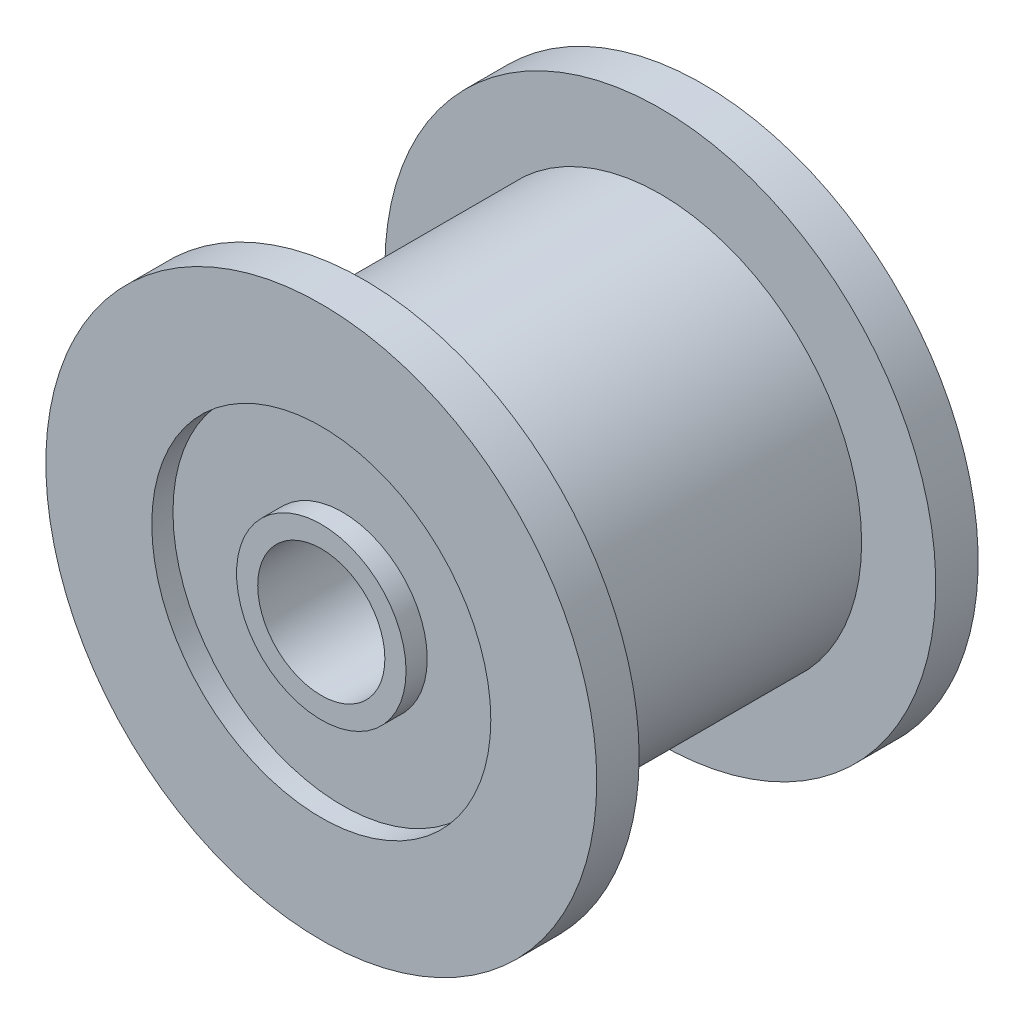
ISO-10303-21;
HEADER;
FILE_DESCRIPTION(('STEP AP214'),'2;1');
FILE_NAME('part.step','',(''),(''),'','','');
FILE_SCHEMA(('AUTOMOTIVE_DESIGN { 1 0 10303 214 1 1 1 1 }'));
ENDSEC;
DATA;
#1=APPLICATION_CONTEXT('core data for automotive mechanical design processes');
#2=APPLICATION_PROTOCOL_DEFINITION('international standard','automotive_design',2000,#1);
#3=PRODUCT_CONTEXT('',#1,'mechanical');
#4=PRODUCT('Part','Part','',(#3));
#5=PRODUCT_RELATED_PRODUCT_CATEGORY('part','',(#4));
#6=PRODUCT_DEFINITION_FORMATION('','',#4);
#7=PRODUCT_DEFINITION_CONTEXT('part definition',#1,'design');
#8=PRODUCT_DEFINITION('design','',#6,#7);
#9=PRODUCT_DEFINITION_SHAPE('','',#8);
#10=(LENGTH_UNIT() NAMED_UNIT(*) SI_UNIT(.MILLI.,.METRE.));
#11=(NAMED_UNIT(*) PLANE_ANGLE_UNIT() SI_UNIT($,.RADIAN.));
#12=(NAMED_UNIT(*) SI_UNIT($,.STERADIAN.) SOLID_ANGLE_UNIT());
#13=UNCERTAINTY_MEASURE_WITH_UNIT(LENGTH_MEASURE(1.E-05),#10,'distance_accuracy_value','');
#14=(GEOMETRIC_REPRESENTATION_CONTEXT(3) GLOBAL_UNCERTAINTY_ASSIGNED_CONTEXT((#13)) GLOBAL_UNIT_ASSIGNED_CONTEXT((#10,
#11,#12)) REPRESENTATION_CONTEXT('',''));
#15=CARTESIAN_POINT('',(0.,0.,0.));
#16=DIRECTION('',(0.,0.,1.));
#17=DIRECTION('',(1.,0.,0.));
#18=AXIS2_PLACEMENT_3D('',#15,#16,#17);
#19=CARTESIAN_POINT('',(0.,0.,8.));
#20=DIRECTION('',(0.,0.,1.));
#21=DIRECTION('',(1.,0.,0.));
#22=AXIS2_PLACEMENT_3D('',#19,#20,#21);
#23=PLANE('',#22);
#24=CARTESIAN_POINT('',(0.,0.,8.));
#25=DIRECTION('',(0.,0.,1.));
#26=DIRECTION('',(1.,0.,0.));
#27=AXIS2_PLACEMENT_3D('',#24,#25,#26);
#28=CIRCLE('',#27,1.5);
#29=CARTESIAN_POINT('',(1.5,0.,8.));
#30=VERTEX_POINT('',#29);
#31=EDGE_CURVE('E58',#30,#30,#28,.T.);
#32=ORIENTED_EDGE('',*,*,#31,.F.);
#33=EDGE_LOOP('',(#32));
#34=FACE_BOUND('',#33,.T.);
#35=CARTESIAN_POINT('',(0.,0.,8.));
#36=DIRECTION('',(0.,0.,1.));
#37=DIRECTION('',(1.,0.,0.));
#38=AXIS2_PLACEMENT_3D('',#35,#36,#37);
#39=CIRCLE('',#38,2.);
#40=CARTESIAN_POINT('',(2.,0.,8.));
#41=VERTEX_POINT('',#40);
#42=EDGE_CURVE('E85',#41,#41,#39,.T.);
#43=ORIENTED_EDGE('',*,*,#42,.T.);
#44=EDGE_LOOP('',(#43));
#45=FACE_BOUND('',#44,.T.);
#46=ADVANCED_FACE('F34',(#34,#45),#23,.T.);
#47=CARTESIAN_POINT('',(0.,0.,-1.));
#48=DIRECTION('',(0.,0.,-1.));
#49=DIRECTION('',(-1.,0.,0.));
#50=AXIS2_PLACEMENT_3D('',#47,#48,#49);
#51=PLANE('',#50);
#52=CARTESIAN_POINT('',(0.,0.,-1.));
#53=DIRECTION('',(0.,0.,-1.));
#54=DIRECTION('',(-1.,0.,0.));
#55=AXIS2_PLACEMENT_3D('',#52,#53,#54);
#56=CIRCLE('',#55,1.5);
#57=CARTESIAN_POINT('',(-1.5,0.,-1.));
#58=VERTEX_POINT('',#57);
#59=EDGE_CURVE('E63',#58,#58,#56,.T.);
#60=ORIENTED_EDGE('',*,*,#59,.F.);
#61=EDGE_LOOP('',(#60));
#62=FACE_BOUND('',#61,.T.);
#63=CARTESIAN_POINT('',(0.,0.,-1.));
#64=DIRECTION('',(0.,0.,-1.));
#65=DIRECTION('',(-1.,0.,0.));
#66=AXIS2_PLACEMENT_3D('',#63,#64,#65);
#67=CIRCLE('',#66,2.);
#68=CARTESIAN_POINT('',(-2.,0.,-1.));
#69=VERTEX_POINT('',#68);
#70=EDGE_CURVE('E73',#69,#69,#67,.T.);
#71=ORIENTED_EDGE('',*,*,#70,.T.);
#72=EDGE_LOOP('',(#71));
#73=FACE_BOUND('',#72,.T.);
#74=ADVANCED_FACE('F124',(#62,#73),#51,.T.);
#75=CARTESIAN_POINT('',(0.,0.,7.));
#76=DIRECTION('',(0.,0.,-1.));
#77=DIRECTION('',(-1.,0.,0.));
#78=AXIS2_PLACEMENT_3D('',#75,#76,#77);
#79=CYLINDRICAL_SURFACE('',#78,4.75);
#80=CARTESIAN_POINT('',(0.,0.,7.));
#81=DIRECTION('',(0.,0.,1.));
#82=DIRECTION('',(1.,0.,0.));
#83=AXIS2_PLACEMENT_3D('',#80,#81,#82);
#84=CIRCLE('',#83,4.75);
#85=CARTESIAN_POINT('',(4.75,0.,7.));
#86=VERTEX_POINT('',#85);
#87=EDGE_CURVE('E10',#86,#86,#84,.T.);
#88=ORIENTED_EDGE('',*,*,#87,.F.);
#89=EDGE_LOOP('',(#88));
#90=FACE_BOUND('',#89,.T.);
#91=CARTESIAN_POINT('',(0.,0.,0.));
#92=DIRECTION('',(0.,0.,-1.));
#93=DIRECTION('',(-1.,0.,0.));
#94=AXIS2_PLACEMENT_3D('',#91,#92,#93);
#95=CIRCLE('',#94,4.75);
#96=CARTESIAN_POINT('',(-4.75,0.,0.));
#97=VERTEX_POINT('',#96);
#98=EDGE_CURVE('E50',#97,#97,#95,.T.);
#99=ORIENTED_EDGE('',*,*,#98,.F.);
#100=EDGE_LOOP('',(#99));
#101=FACE_BOUND('',#100,.T.);
#102=ADVANCED_FACE('F36',(#90,#101),#79,.T.);
#103=CARTESIAN_POINT('',(0.,0.,7.));
#104=DIRECTION('',(0.,0.,1.));
#105=DIRECTION('',(1.,0.,0.));
#106=AXIS2_PLACEMENT_3D('',#103,#104,#105);
#107=PLANE('',#106);
#108=CARTESIAN_POINT('',(0.,0.,7.));
#109=DIRECTION('',(0.,0.,1.));
#110=DIRECTION('',(1.,0.,0.));
#111=AXIS2_PLACEMENT_3D('',#108,#109,#110);
#112=CIRCLE('',#111,6.5);
#113=CARTESIAN_POINT('',(6.5,0.,7.));
#114=VERTEX_POINT('',#113);
#115=EDGE_CURVE('E45',#114,#114,#112,.T.);
#116=ORIENTED_EDGE('',*,*,#115,.F.);
#117=EDGE_LOOP('',(#116));
#118=FACE_BOUND('',#117,.T.);
#119=ORIENTED_EDGE('',*,*,#87,.T.);
#120=EDGE_LOOP('',(#119));
#121=FACE_BOUND('',#120,.T.);
#122=ADVANCED_FACE('F119',(#118,#121),#107,.F.);
#123=CARTESIAN_POINT('',(0.,0.,8.));
#124=DIRECTION('',(0.,0.,-1.));
#125=DIRECTION('',(-1.,0.,0.));
#126=AXIS2_PLACEMENT_3D('',#123,#124,#125);
#127=CYLINDRICAL_SURFACE('',#126,6.5);
#128=CARTESIAN_POINT('',(0.,0.,8.));
#129=DIRECTION('',(0.,0.,1.));
#130=DIRECTION('',(1.,0.,0.));
#131=AXIS2_PLACEMENT_3D('',#128,#129,#130);
#132=CIRCLE('',#131,6.5);
#133=CARTESIAN_POINT('',(6.5,0.,8.));
#134=VERTEX_POINT('',#133);
#135=EDGE_CURVE('E41',#134,#134,#132,.T.);
#136=ORIENTED_EDGE('',*,*,#135,.F.);
#137=EDGE_LOOP('',(#136));
#138=FACE_BOUND('',#137,.T.);
#139=ORIENTED_EDGE('',*,*,#115,.T.);
#140=EDGE_LOOP('',(#139));
#141=FACE_BOUND('',#140,.T.);
#142=ADVANCED_FACE('F110',(#138,#141),#127,.T.);
#143=CARTESIAN_POINT('',(0.,0.,8.));
#144=DIRECTION('',(0.,0.,1.));
#145=DIRECTION('',(1.,0.,0.));
#146=AXIS2_PLACEMENT_3D('',#143,#144,#145);
#147=CIRCLE('',#146,4.);
#148=CARTESIAN_POINT('',(4.,0.,8.));
#149=VERTEX_POINT('',#148);
#150=EDGE_CURVE('E79',#149,#149,#147,.T.);
#151=ORIENTED_EDGE('',*,*,#150,.F.);
#152=EDGE_LOOP('',(#151));
#153=FACE_BOUND('',#152,.T.);
#154=ORIENTED_EDGE('',*,*,#135,.T.);
#155=EDGE_LOOP('',(#154));
#156=FACE_BOUND('',#155,.T.);
#157=ADVANCED_FACE('F107',(#153,#156),#23,.T.);
#158=CARTESIAN_POINT('',(0.,0.,0.));
#159=DIRECTION('',(0.,0.,-1.));
#160=DIRECTION('',(-1.,0.,0.));
#161=AXIS2_PLACEMENT_3D('',#158,#159,#160);
#162=PLANE('',#161);
#163=CARTESIAN_POINT('',(0.,0.,0.));
#164=DIRECTION('',(0.,0.,-1.));
#165=DIRECTION('',(-1.,0.,0.));
#166=AXIS2_PLACEMENT_3D('',#163,#164,#165);
#167=CIRCLE('',#166,6.5);
#168=CARTESIAN_POINT('',(-6.5,0.,0.));
#169=VERTEX_POINT('',#168);
#170=EDGE_CURVE('E55',#169,#169,#167,.T.);
#171=ORIENTED_EDGE('',*,*,#170,.F.);
#172=EDGE_LOOP('',(#171));
#173=FACE_BOUND('',#172,.T.);
#174=ORIENTED_EDGE('',*,*,#98,.T.);
#175=EDGE_LOOP('',(#174));
#176=FACE_BOUND('',#175,.T.);
#177=ADVANCED_FACE('F109',(#173,#176),#162,.F.);
#178=CARTESIAN_POINT('',(0.,0.,-1.));
#179=DIRECTION('',(0.,0.,1.));
#180=DIRECTION('',(1.,0.,0.));
#181=AXIS2_PLACEMENT_3D('',#178,#179,#180);
#182=CYLINDRICAL_SURFACE('',#181,6.5);
#183=CARTESIAN_POINT('',(0.,0.,-1.));
#184=DIRECTION('',(0.,0.,-1.));
#185=DIRECTION('',(-1.,0.,0.));
#186=AXIS2_PLACEMENT_3D('',#183,#184,#185);
#187=CIRCLE('',#186,6.5);
#188=CARTESIAN_POINT('',(-6.5,0.,-1.));
#189=VERTEX_POINT('',#188);
#190=EDGE_CURVE('E54',#189,#189,#187,.T.);
#191=ORIENTED_EDGE('',*,*,#190,.F.);
#192=EDGE_LOOP('',(#191));
#193=FACE_BOUND('',#192,.T.);
#194=ORIENTED_EDGE('',*,*,#170,.T.);
#195=EDGE_LOOP('',(#194));
#196=FACE_BOUND('',#195,.T.);
#197=ADVANCED_FACE('F116',(#193,#196),#182,.T.);
#198=CARTESIAN_POINT('',(0.,0.,-1.));
#199=DIRECTION('',(0.,0.,-1.));
#200=DIRECTION('',(-1.,0.,0.));
#201=AXIS2_PLACEMENT_3D('',#198,#199,#200);
#202=CIRCLE('',#201,4.);
#203=CARTESIAN_POINT('',(-4.,0.,-1.));
#204=VERTEX_POINT('',#203);
#205=EDGE_CURVE('E67',#204,#204,#202,.T.);
#206=ORIENTED_EDGE('',*,*,#205,.F.);
#207=EDGE_LOOP('',(#206));
#208=FACE_BOUND('',#207,.T.);
#209=ORIENTED_EDGE('',*,*,#190,.T.);
#210=EDGE_LOOP('',(#209));
#211=FACE_BOUND('',#210,.T.);
#212=ADVANCED_FACE('F131',(#208,#211),#51,.T.);
#213=CARTESIAN_POINT('',(0.,0.,11.));
#214=DIRECTION('',(0.,0.,-1.));
#215=DIRECTION('',(-1.,0.,0.));
#216=AXIS2_PLACEMENT_3D('',#213,#214,#215);
#217=CYLINDRICAL_SURFACE('',#216,1.5);
#218=ORIENTED_EDGE('',*,*,#31,.T.);
#219=EDGE_LOOP('',(#218));
#220=FACE_BOUND('',#219,.T.);
#221=ORIENTED_EDGE('',*,*,#59,.T.);
#222=EDGE_LOOP('',(#221));
#223=FACE_BOUND('',#222,.T.);
#224=ADVANCED_FACE('F150',(#220,#223),#217,.F.);
#225=CARTESIAN_POINT('',(0.,0.,-0.5));
#226=DIRECTION('',(0.,0.,-1.));
#227=DIRECTION('',(-1.,0.,0.));
#228=AXIS2_PLACEMENT_3D('',#225,#226,#227);
#229=CYLINDRICAL_SURFACE('',#228,4.);
#230=CARTESIAN_POINT('',(0.,0.,-0.5));
#231=DIRECTION('',(0.,0.,-1.));
#232=DIRECTION('',(-1.,0.,0.));
#233=AXIS2_PLACEMENT_3D('',#230,#231,#232);
#234=CIRCLE('',#233,4.);
#235=CARTESIAN_POINT('',(-4.,0.,-0.5));
#236=VERTEX_POINT('',#235);
#237=EDGE_CURVE('E66',#236,#236,#234,.T.);
#238=ORIENTED_EDGE('',*,*,#237,.F.);
#239=EDGE_LOOP('',(#238));
#240=FACE_BOUND('',#239,.T.);
#241=ORIENTED_EDGE('',*,*,#205,.T.);
#242=EDGE_LOOP('',(#241));
#243=FACE_BOUND('',#242,.T.);
#244=ADVANCED_FACE('F146',(#240,#243),#229,.F.);
#245=CARTESIAN_POINT('',(0.,0.,-0.5));
#246=DIRECTION('',(0.,0.,-1.));
#247=DIRECTION('',(-1.,0.,0.));
#248=AXIS2_PLACEMENT_3D('',#245,#246,#247);
#249=PLANE('',#248);
#250=CARTESIAN_POINT('',(0.,0.,-0.5));
#251=DIRECTION('',(0.,0.,-1.));
#252=DIRECTION('',(-1.,0.,0.));
#253=AXIS2_PLACEMENT_3D('',#250,#251,#252);
#254=CIRCLE('',#253,2.);
#255=CARTESIAN_POINT('',(-2.,0.,-0.5));
#256=VERTEX_POINT('',#255);
#257=EDGE_CURVE('E70',#256,#256,#254,.T.);
#258=ORIENTED_EDGE('',*,*,#257,.F.);
#259=EDGE_LOOP('',(#258));
#260=FACE_BOUND('',#259,.T.);
#261=ORIENTED_EDGE('',*,*,#237,.T.);
#262=EDGE_LOOP('',(#261));
#263=FACE_BOUND('',#262,.T.);
#264=ADVANCED_FACE('F142',(#260,#263),#249,.T.);
#265=CARTESIAN_POINT('',(0.,0.,-0.5));
#266=DIRECTION('',(0.,0.,-1.));
#267=DIRECTION('',(-1.,0.,0.));
#268=AXIS2_PLACEMENT_3D('',#265,#266,#267);
#269=CYLINDRICAL_SURFACE('',#268,2.);
#270=ORIENTED_EDGE('',*,*,#257,.T.);
#271=EDGE_LOOP('',(#270));
#272=FACE_BOUND('',#271,.T.);
#273=ORIENTED_EDGE('',*,*,#70,.F.);
#274=EDGE_LOOP('',(#273));
#275=FACE_BOUND('',#274,.T.);
#276=ADVANCED_FACE('F103',(#272,#275),#269,.T.);
#277=CARTESIAN_POINT('',(0.,0.,7.5));
#278=DIRECTION('',(0.,0.,1.));
#279=DIRECTION('',(1.,0.,0.));
#280=AXIS2_PLACEMENT_3D('',#277,#278,#279);
#281=CYLINDRICAL_SURFACE('',#280,4.);
#282=CARTESIAN_POINT('',(0.,0.,7.5));
#283=DIRECTION('',(0.,0.,1.));
#284=DIRECTION('',(1.,0.,0.));
#285=AXIS2_PLACEMENT_3D('',#282,#283,#284);
#286=CIRCLE('',#285,4.);
#287=CARTESIAN_POINT('',(4.,0.,7.5));
#288=VERTEX_POINT('',#287);
#289=EDGE_CURVE('E76',#288,#288,#286,.T.);
#290=ORIENTED_EDGE('',*,*,#289,.F.);
#291=EDGE_LOOP('',(#290));
#292=FACE_BOUND('',#291,.T.);
#293=ORIENTED_EDGE('',*,*,#150,.T.);
#294=EDGE_LOOP('',(#293));
#295=FACE_BOUND('',#294,.T.);
#296=ADVANCED_FACE('F97',(#292,#295),#281,.F.);
#297=CARTESIAN_POINT('',(0.,0.,7.5));
#298=DIRECTION('',(0.,0.,1.));
#299=DIRECTION('',(1.,0.,0.));
#300=AXIS2_PLACEMENT_3D('',#297,#298,#299);
#301=PLANE('',#300);
#302=CARTESIAN_POINT('',(0.,0.,7.5));
#303=DIRECTION('',(0.,0.,1.));
#304=DIRECTION('',(1.,0.,0.));
#305=AXIS2_PLACEMENT_3D('',#302,#303,#304);
#306=CIRCLE('',#305,2.);
#307=CARTESIAN_POINT('',(2.,0.,7.5));
#308=VERTEX_POINT('',#307);
#309=EDGE_CURVE('E82',#308,#308,#306,.T.);
#310=ORIENTED_EDGE('',*,*,#309,.F.);
#311=EDGE_LOOP('',(#310));
#312=FACE_BOUND('',#311,.T.);
#313=ORIENTED_EDGE('',*,*,#289,.T.);
#314=EDGE_LOOP('',(#313));
#315=FACE_BOUND('',#314,.T.);
#316=ADVANCED_FACE('F94',(#312,#315),#301,.T.);
#317=CARTESIAN_POINT('',(0.,0.,7.5));
#318=DIRECTION('',(0.,0.,1.));
#319=DIRECTION('',(1.,0.,0.));
#320=AXIS2_PLACEMENT_3D('',#317,#318,#319);
#321=CYLINDRICAL_SURFACE('',#320,2.);
#322=ORIENTED_EDGE('',*,*,#309,.T.);
#323=EDGE_LOOP('',(#322));
#324=FACE_BOUND('',#323,.T.);
#325=ORIENTED_EDGE('',*,*,#42,.F.);
#326=EDGE_LOOP('',(#325));
#327=FACE_BOUND('',#326,.T.);
#328=ADVANCED_FACE('F91',(#324,#327),#321,.T.);
#329=CLOSED_SHELL('',(#46,#74,#102,#122,#142,#157,#177,#197,#212,#224,#244,#264,#276,#296,#316,#328));
#330=MANIFOLD_SOLID_BREP('B2',#329);
#331=ADVANCED_BREP_SHAPE_REPRESENTATION('',(#18,#330),#14);
#332=SHAPE_DEFINITION_REPRESENTATION(#9,#331);
ENDSEC;
END-ISO-10303-21;
